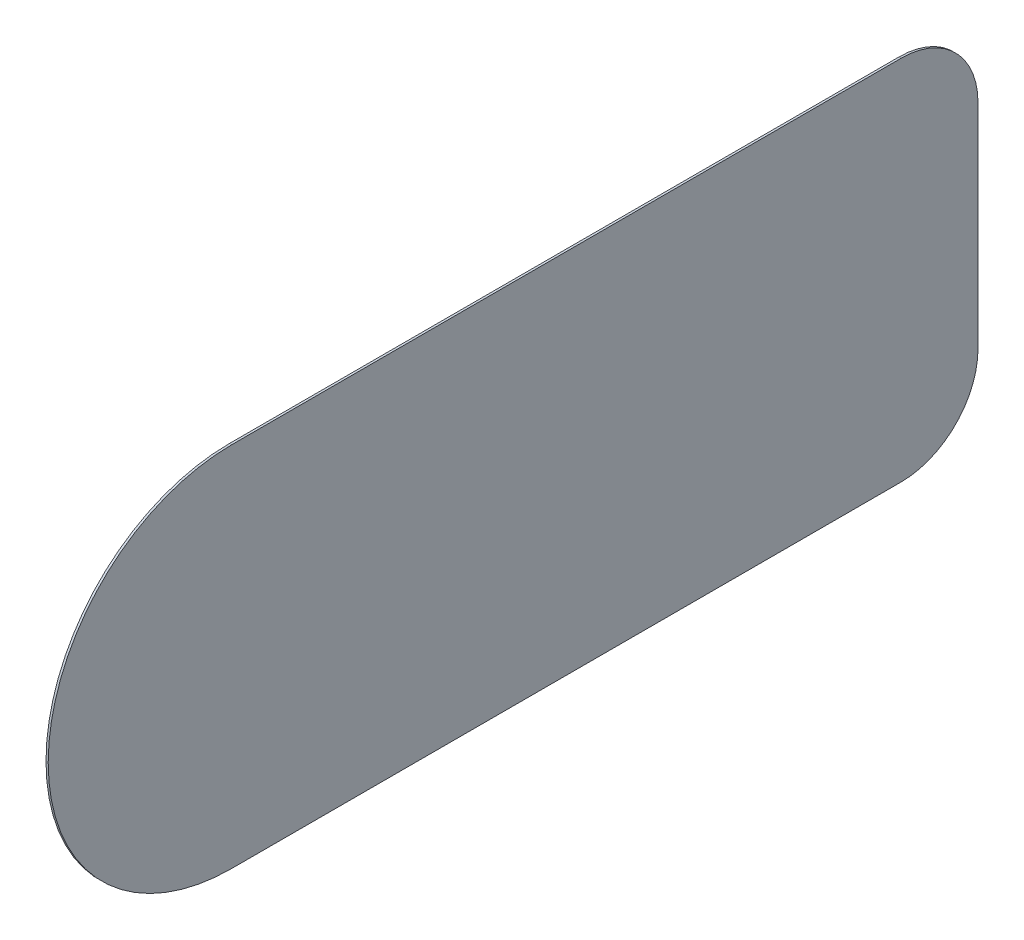
ISO-10303-21;
HEADER;
FILE_DESCRIPTION(('STEP AP214'),'2;1');
FILE_NAME('part.step','',(''),(''),'','','');
FILE_SCHEMA(('AUTOMOTIVE_DESIGN { 1 0 10303 214 1 1 1 1 }'));
ENDSEC;
DATA;
#1=APPLICATION_CONTEXT('core data for automotive mechanical design processes');
#2=APPLICATION_PROTOCOL_DEFINITION('international standard','automotive_design',2000,#1);
#3=PRODUCT_CONTEXT('',#1,'mechanical');
#4=PRODUCT('Part','Part','',(#3));
#5=PRODUCT_RELATED_PRODUCT_CATEGORY('part','',(#4));
#6=PRODUCT_DEFINITION_FORMATION('','',#4);
#7=PRODUCT_DEFINITION_CONTEXT('part definition',#1,'design');
#8=PRODUCT_DEFINITION('design','',#6,#7);
#9=PRODUCT_DEFINITION_SHAPE('','',#8);
#10=(LENGTH_UNIT() NAMED_UNIT(*) SI_UNIT(.MILLI.,.METRE.));
#11=(NAMED_UNIT(*) PLANE_ANGLE_UNIT() SI_UNIT($,.RADIAN.));
#12=(NAMED_UNIT(*) SI_UNIT($,.STERADIAN.) SOLID_ANGLE_UNIT());
#13=UNCERTAINTY_MEASURE_WITH_UNIT(LENGTH_MEASURE(1.E-05),#10,'distance_accuracy_value','');
#14=(GEOMETRIC_REPRESENTATION_CONTEXT(3) GLOBAL_UNCERTAINTY_ASSIGNED_CONTEXT((#13)) GLOBAL_UNIT_ASSIGNED_CONTEXT((#10,
#11,#12)) REPRESENTATION_CONTEXT('',''));
#15=CARTESIAN_POINT('',(0.,0.,0.));
#16=DIRECTION('',(0.,0.,1.));
#17=DIRECTION('',(1.,0.,0.));
#18=AXIS2_PLACEMENT_3D('',#15,#16,#17);
#19=CARTESIAN_POINT('',(10.,836.,0.));
#20=DIRECTION('',(-1.,0.,0.));
#21=DIRECTION('',(0.,0.,1.));
#22=AXIS2_PLACEMENT_3D('',#19,#20,#21);
#23=CYLINDRICAL_SURFACE('',#22,836.);
#24=CARTESIAN_POINT('',(0.,836.,0.));
#25=DIRECTION('',(1.,0.,0.));
#26=DIRECTION('',(0.,0.,-1.));
#27=AXIS2_PLACEMENT_3D('',#24,#25,#26);
#28=CIRCLE('',#27,836.);
#29=CARTESIAN_POINT('',(0.,1672.,0.));
#30=VERTEX_POINT('',#29);
#31=CARTESIAN_POINT('',(0.,0.,0.));
#32=VERTEX_POINT('',#31);
#33=EDGE_CURVE('E128',#30,#32,#28,.T.);
#34=ORIENTED_EDGE('',*,*,#33,.T.);
#35=DIRECTION('',(-1.,0.,0.));
#36=VECTOR('',#35,1.);
#37=CARTESIAN_POINT('',(10.,0.,0.));
#38=LINE('',#37,#36);
#39=CARTESIAN_POINT('',(10.,0.,0.));
#40=VERTEX_POINT('',#39);
#41=EDGE_CURVE('E11',#40,#32,#38,.T.);
#42=ORIENTED_EDGE('',*,*,#41,.F.);
#43=CARTESIAN_POINT('',(10.,836.,0.));
#44=DIRECTION('',(1.,0.,0.));
#45=DIRECTION('',(0.,0.,-1.));
#46=AXIS2_PLACEMENT_3D('',#43,#44,#45);
#47=CIRCLE('',#46,836.);
#48=CARTESIAN_POINT('',(10.,1672.,0.));
#49=VERTEX_POINT('',#48);
#50=EDGE_CURVE('E144',#49,#40,#47,.T.);
#51=ORIENTED_EDGE('',*,*,#50,.F.);
#52=DIRECTION('',(-1.,0.,0.));
#53=VECTOR('',#52,1.);
#54=CARTESIAN_POINT('',(10.,1672.,0.));
#55=LINE('',#54,#53);
#56=EDGE_CURVE('E124',#49,#30,#55,.T.);
#57=ORIENTED_EDGE('',*,*,#56,.T.);
#58=EDGE_LOOP('',(#34,#42,#51,#57));
#59=FACE_BOUND('',#58,.T.);
#60=ADVANCED_FACE('F39',(#59),#23,.T.);
#61=CARTESIAN_POINT('',(10.,0.,0.));
#62=DIRECTION('',(0.,1.,0.));
#63=DIRECTION('',(0.,0.,1.));
#64=AXIS2_PLACEMENT_3D('',#61,#62,#63);
#65=PLANE('',#64);
#66=DIRECTION('',(0.,0.,-1.));
#67=VECTOR('',#66,1.);
#68=CARTESIAN_POINT('',(0.,0.,0.));
#69=LINE('',#68,#67);
#70=CARTESIAN_POINT('',(0.,0.,-3050.));
#71=VERTEX_POINT('',#70);
#72=EDGE_CURVE('E132',#32,#71,#69,.T.);
#73=ORIENTED_EDGE('',*,*,#72,.T.);
#74=DIRECTION('',(-1.,0.,0.));
#75=VECTOR('',#74,1.);
#76=CARTESIAN_POINT('',(10.,0.,-3050.));
#77=LINE('',#76,#75);
#78=CARTESIAN_POINT('',(10.,0.,-3050.));
#79=VERTEX_POINT('',#78);
#80=EDGE_CURVE('E48',#79,#71,#77,.T.);
#81=ORIENTED_EDGE('',*,*,#80,.F.);
#82=DIRECTION('',(0.,0.,-1.));
#83=VECTOR('',#82,1.);
#84=CARTESIAN_POINT('',(10.,0.,0.));
#85=LINE('',#84,#83);
#86=EDGE_CURVE('E93',#40,#79,#85,.T.);
#87=ORIENTED_EDGE('',*,*,#86,.F.);
#88=ORIENTED_EDGE('',*,*,#41,.T.);
#89=EDGE_LOOP('',(#73,#81,#87,#88));
#90=FACE_BOUND('',#89,.T.);
#91=ADVANCED_FACE('F172',(#90),#65,.F.);
#92=CARTESIAN_POINT('',(10.,350.,-3050.));
#93=DIRECTION('',(-1.,0.,0.));
#94=DIRECTION('',(0.,0.,1.));
#95=AXIS2_PLACEMENT_3D('',#92,#93,#94);
#96=CYLINDRICAL_SURFACE('',#95,350.);
#97=CARTESIAN_POINT('',(0.,350.,-3050.));
#98=DIRECTION('',(1.,0.,0.));
#99=DIRECTION('',(0.,0.,-1.));
#100=AXIS2_PLACEMENT_3D('',#97,#98,#99);
#101=CIRCLE('',#100,350.);
#102=CARTESIAN_POINT('',(0.,350.,-3400.));
#103=VERTEX_POINT('',#102);
#104=EDGE_CURVE('E135',#71,#103,#101,.T.);
#105=ORIENTED_EDGE('',*,*,#104,.T.);
#106=DIRECTION('',(-1.,0.,0.));
#107=VECTOR('',#106,1.);
#108=CARTESIAN_POINT('',(10.,350.,-3400.));
#109=LINE('',#108,#107);
#110=CARTESIAN_POINT('',(10.,350.,-3400.));
#111=VERTEX_POINT('',#110);
#112=EDGE_CURVE('E117',#111,#103,#109,.T.);
#113=ORIENTED_EDGE('',*,*,#112,.F.);
#114=CARTESIAN_POINT('',(10.,350.,-3050.));
#115=DIRECTION('',(1.,0.,0.));
#116=DIRECTION('',(0.,0.,-1.));
#117=AXIS2_PLACEMENT_3D('',#114,#115,#116);
#118=CIRCLE('',#117,350.);
#119=EDGE_CURVE('E106',#79,#111,#118,.T.);
#120=ORIENTED_EDGE('',*,*,#119,.F.);
#121=ORIENTED_EDGE('',*,*,#80,.T.);
#122=EDGE_LOOP('',(#105,#113,#120,#121));
#123=FACE_BOUND('',#122,.T.);
#124=ADVANCED_FACE('F154',(#123),#96,.T.);
#125=CARTESIAN_POINT('',(10.,350.,-3400.));
#126=DIRECTION('',(0.,0.,1.));
#127=DIRECTION('',(1.,0.,0.));
#128=AXIS2_PLACEMENT_3D('',#125,#126,#127);
#129=PLANE('',#128);
#130=DIRECTION('',(0.,1.,0.));
#131=VECTOR('',#130,1.);
#132=CARTESIAN_POINT('',(0.,350.,-3400.));
#133=LINE('',#132,#131);
#134=CARTESIAN_POINT('',(0.,1322.,-3400.));
#135=VERTEX_POINT('',#134);
#136=EDGE_CURVE('E115',#103,#135,#133,.T.);
#137=ORIENTED_EDGE('',*,*,#136,.T.);
#138=DIRECTION('',(-1.,0.,0.));
#139=VECTOR('',#138,1.);
#140=CARTESIAN_POINT('',(10.,1322.,-3400.));
#141=LINE('',#140,#139);
#142=CARTESIAN_POINT('',(10.,1322.,-3400.));
#143=VERTEX_POINT('',#142);
#144=EDGE_CURVE('E112',#143,#135,#141,.T.);
#145=ORIENTED_EDGE('',*,*,#144,.F.);
#146=DIRECTION('',(0.,1.,0.));
#147=VECTOR('',#146,1.);
#148=CARTESIAN_POINT('',(10.,350.,-3400.));
#149=LINE('',#148,#147);
#150=EDGE_CURVE('E100',#111,#143,#149,.T.);
#151=ORIENTED_EDGE('',*,*,#150,.F.);
#152=ORIENTED_EDGE('',*,*,#112,.T.);
#153=EDGE_LOOP('',(#137,#145,#151,#152));
#154=FACE_BOUND('',#153,.T.);
#155=ADVANCED_FACE('F113',(#154),#129,.F.);
#156=CARTESIAN_POINT('',(10.,1322.,-3050.));
#157=DIRECTION('',(-1.,0.,0.));
#158=DIRECTION('',(0.,0.,1.));
#159=AXIS2_PLACEMENT_3D('',#156,#157,#158);
#160=CYLINDRICAL_SURFACE('',#159,350.);
#161=CARTESIAN_POINT('',(0.,1322.,-3050.));
#162=DIRECTION('',(1.,0.,0.));
#163=DIRECTION('',(0.,0.,-1.));
#164=AXIS2_PLACEMENT_3D('',#161,#162,#163);
#165=CIRCLE('',#164,350.);
#166=CARTESIAN_POINT('',(0.,1672.,-3050.));
#167=VERTEX_POINT('',#166);
#168=EDGE_CURVE('E79',#135,#167,#165,.T.);
#169=ORIENTED_EDGE('',*,*,#168,.T.);
#170=DIRECTION('',(-1.,0.,0.));
#171=VECTOR('',#170,1.);
#172=CARTESIAN_POINT('',(10.,1672.,-3050.));
#173=LINE('',#172,#171);
#174=CARTESIAN_POINT('',(10.,1672.,-3050.));
#175=VERTEX_POINT('',#174);
#176=EDGE_CURVE('E118',#175,#167,#173,.T.);
#177=ORIENTED_EDGE('',*,*,#176,.F.);
#178=CARTESIAN_POINT('',(10.,1322.,-3050.));
#179=DIRECTION('',(1.,0.,0.));
#180=DIRECTION('',(0.,0.,-1.));
#181=AXIS2_PLACEMENT_3D('',#178,#179,#180);
#182=CIRCLE('',#181,350.);
#183=EDGE_CURVE('E104',#143,#175,#182,.T.);
#184=ORIENTED_EDGE('',*,*,#183,.F.);
#185=ORIENTED_EDGE('',*,*,#144,.T.);
#186=EDGE_LOOP('',(#169,#177,#184,#185));
#187=FACE_BOUND('',#186,.T.);
#188=ADVANCED_FACE('F120',(#187),#160,.T.);
#189=CARTESIAN_POINT('',(10.,1672.,-3050.));
#190=DIRECTION('',(0.,-1.,0.));
#191=DIRECTION('',(0.,0.,-1.));
#192=AXIS2_PLACEMENT_3D('',#189,#190,#191);
#193=PLANE('',#192);
#194=DIRECTION('',(0.,0.,1.));
#195=VECTOR('',#194,1.);
#196=CARTESIAN_POINT('',(0.,1672.,-3050.));
#197=LINE('',#196,#195);
#198=EDGE_CURVE('E85',#167,#30,#197,.T.);
#199=ORIENTED_EDGE('',*,*,#198,.T.);
#200=ORIENTED_EDGE('',*,*,#56,.F.);
#201=DIRECTION('',(0.,0.,1.));
#202=VECTOR('',#201,1.);
#203=CARTESIAN_POINT('',(10.,1672.,-3050.));
#204=LINE('',#203,#202);
#205=EDGE_CURVE('E56',#175,#49,#204,.T.);
#206=ORIENTED_EDGE('',*,*,#205,.F.);
#207=ORIENTED_EDGE('',*,*,#176,.T.);
#208=EDGE_LOOP('',(#199,#200,#206,#207));
#209=FACE_BOUND('',#208,.T.);
#210=ADVANCED_FACE('F161',(#209),#193,.F.);
#211=CARTESIAN_POINT('',(10.,836.,0.));
#212=DIRECTION('',(1.,0.,0.));
#213=DIRECTION('',(0.,0.,-1.));
#214=AXIS2_PLACEMENT_3D('',#211,#212,#213);
#215=PLANE('',#214);
#216=ORIENTED_EDGE('',*,*,#50,.T.);
#217=ORIENTED_EDGE('',*,*,#86,.T.);
#218=ORIENTED_EDGE('',*,*,#119,.T.);
#219=ORIENTED_EDGE('',*,*,#150,.T.);
#220=ORIENTED_EDGE('',*,*,#183,.T.);
#221=ORIENTED_EDGE('',*,*,#205,.T.);
#222=EDGE_LOOP('',(#216,#217,#218,#219,#220,#221));
#223=FACE_BOUND('',#222,.T.);
#224=ADVANCED_FACE('F102',(#223),#215,.T.);
#225=CARTESIAN_POINT('',(0.,836.,0.));
#226=DIRECTION('',(1.,0.,0.));
#227=DIRECTION('',(0.,0.,-1.));
#228=AXIS2_PLACEMENT_3D('',#225,#226,#227);
#229=PLANE('',#228);
#230=ORIENTED_EDGE('',*,*,#33,.F.);
#231=ORIENTED_EDGE('',*,*,#198,.F.);
#232=ORIENTED_EDGE('',*,*,#168,.F.);
#233=ORIENTED_EDGE('',*,*,#136,.F.);
#234=ORIENTED_EDGE('',*,*,#104,.F.);
#235=ORIENTED_EDGE('',*,*,#72,.F.);
#236=EDGE_LOOP('',(#230,#231,#232,#233,#234,#235));
#237=FACE_BOUND('',#236,.T.);
#238=ADVANCED_FACE('F157',(#237),#229,.F.);
#239=CLOSED_SHELL('',(#60,#91,#124,#155,#188,#210,#224,#238));
#240=MANIFOLD_SOLID_BREP('B2',#239);
#241=ADVANCED_BREP_SHAPE_REPRESENTATION('',(#18,#240),#14);
#242=SHAPE_DEFINITION_REPRESENTATION(#9,#241);
ENDSEC;
END-ISO-10303-21;
